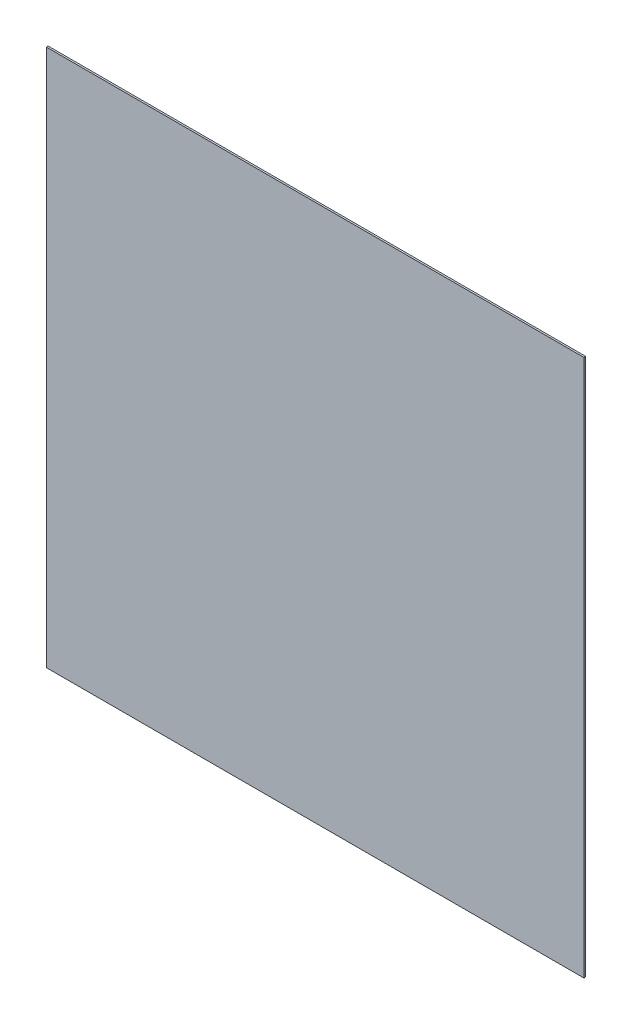
ISO-10303-21;
HEADER;
FILE_DESCRIPTION(('STEP AP214'),'2;1');
FILE_NAME('part.step','',(''),(''),'','','');
FILE_SCHEMA(('AUTOMOTIVE_DESIGN { 1 0 10303 214 1 1 1 1 }'));
ENDSEC;
DATA;
#1=APPLICATION_CONTEXT('core data for automotive mechanical design processes');
#2=APPLICATION_PROTOCOL_DEFINITION('international standard','automotive_design',2000,#1);
#3=PRODUCT_CONTEXT('',#1,'mechanical');
#4=PRODUCT('Part','Part','',(#3));
#5=PRODUCT_RELATED_PRODUCT_CATEGORY('part','',(#4));
#6=PRODUCT_DEFINITION_FORMATION('','',#4);
#7=PRODUCT_DEFINITION_CONTEXT('part definition',#1,'design');
#8=PRODUCT_DEFINITION('design','',#6,#7);
#9=PRODUCT_DEFINITION_SHAPE('','',#8);
#10=(LENGTH_UNIT() NAMED_UNIT(*) SI_UNIT(.MILLI.,.METRE.));
#11=(NAMED_UNIT(*) PLANE_ANGLE_UNIT() SI_UNIT($,.RADIAN.));
#12=(NAMED_UNIT(*) SI_UNIT($,.STERADIAN.) SOLID_ANGLE_UNIT());
#13=UNCERTAINTY_MEASURE_WITH_UNIT(LENGTH_MEASURE(1.E-05),#10,'distance_accuracy_value','');
#14=(GEOMETRIC_REPRESENTATION_CONTEXT(3) GLOBAL_UNCERTAINTY_ASSIGNED_CONTEXT((#13)) GLOBAL_UNIT_ASSIGNED_CONTEXT((#10,
#11,#12)) REPRESENTATION_CONTEXT('',''));
#15=CARTESIAN_POINT('',(0.,0.,0.));
#16=DIRECTION('',(0.,0.,1.));
#17=DIRECTION('',(1.,0.,0.));
#18=AXIS2_PLACEMENT_3D('',#15,#16,#17);
#19=CARTESIAN_POINT('',(0.,0.,1.));
#20=DIRECTION('',(1.,0.,0.));
#21=DIRECTION('',(0.,1.,0.));
#22=AXIS2_PLACEMENT_3D('',#19,#20,#21);
#23=PLANE('',#22);
#24=DIRECTION('',(0.,-1.,0.));
#25=VECTOR('',#24,1.);
#26=CARTESIAN_POINT('',(0.,0.,0.));
#27=LINE('',#26,#25);
#28=CARTESIAN_POINT('',(0.,300.,0.));
#29=VERTEX_POINT('',#28);
#30=CARTESIAN_POINT('',(0.,0.,0.));
#31=VERTEX_POINT('',#30);
#32=EDGE_CURVE('E107',#29,#31,#27,.T.);
#33=ORIENTED_EDGE('',*,*,#32,.T.);
#34=DIRECTION('',(0.,0.,-1.));
#35=VECTOR('',#34,1.);
#36=CARTESIAN_POINT('',(0.,0.,1.));
#37=LINE('',#36,#35);
#38=CARTESIAN_POINT('',(0.,0.,1.));
#39=VERTEX_POINT('',#38);
#40=EDGE_CURVE('E11',#39,#31,#37,.T.);
#41=ORIENTED_EDGE('',*,*,#40,.F.);
#42=DIRECTION('',(0.,-1.,0.));
#43=VECTOR('',#42,1.);
#44=CARTESIAN_POINT('',(0.,0.,1.));
#45=LINE('',#44,#43);
#46=CARTESIAN_POINT('',(0.,300.,1.));
#47=VERTEX_POINT('',#46);
#48=EDGE_CURVE('E91',#47,#39,#45,.T.);
#49=ORIENTED_EDGE('',*,*,#48,.F.);
#50=DIRECTION('',(0.,0.,-1.));
#51=VECTOR('',#50,1.);
#52=CARTESIAN_POINT('',(0.,300.,1.));
#53=LINE('',#52,#51);
#54=EDGE_CURVE('E103',#47,#29,#53,.T.);
#55=ORIENTED_EDGE('',*,*,#54,.T.);
#56=EDGE_LOOP('',(#33,#41,#49,#55));
#57=FACE_BOUND('',#56,.T.);
#58=ADVANCED_FACE('F39',(#57),#23,.F.);
#59=CARTESIAN_POINT('',(0.,0.,1.));
#60=DIRECTION('',(0.,1.,0.));
#61=DIRECTION('',(0.,0.,1.));
#62=AXIS2_PLACEMENT_3D('',#59,#60,#61);
#63=PLANE('',#62);
#64=DIRECTION('',(1.,0.,0.));
#65=VECTOR('',#64,1.);
#66=CARTESIAN_POINT('',(0.,0.,0.));
#67=LINE('',#66,#65);
#68=CARTESIAN_POINT('',(300.,0.,0.));
#69=VERTEX_POINT('',#68);
#70=EDGE_CURVE('E96',#31,#69,#67,.T.);
#71=ORIENTED_EDGE('',*,*,#70,.T.);
#72=DIRECTION('',(0.,0.,-1.));
#73=VECTOR('',#72,1.);
#74=CARTESIAN_POINT('',(300.,0.,1.));
#75=LINE('',#74,#73);
#76=CARTESIAN_POINT('',(300.,0.,1.));
#77=VERTEX_POINT('',#76);
#78=EDGE_CURVE('E48',#77,#69,#75,.T.);
#79=ORIENTED_EDGE('',*,*,#78,.F.);
#80=DIRECTION('',(1.,0.,0.));
#81=VECTOR('',#80,1.);
#82=CARTESIAN_POINT('',(0.,0.,1.));
#83=LINE('',#82,#81);
#84=EDGE_CURVE('E86',#39,#77,#83,.T.);
#85=ORIENTED_EDGE('',*,*,#84,.F.);
#86=ORIENTED_EDGE('',*,*,#40,.T.);
#87=EDGE_LOOP('',(#71,#79,#85,#86));
#88=FACE_BOUND('',#87,.T.);
#89=ADVANCED_FACE('F95',(#88),#63,.F.);
#90=CARTESIAN_POINT('',(300.,0.,1.));
#91=DIRECTION('',(-1.,0.,0.));
#92=DIRECTION('',(0.,0.,1.));
#93=AXIS2_PLACEMENT_3D('',#90,#91,#92);
#94=PLANE('',#93);
#95=DIRECTION('',(0.,1.,0.));
#96=VECTOR('',#95,1.);
#97=CARTESIAN_POINT('',(300.,0.,0.));
#98=LINE('',#97,#96);
#99=CARTESIAN_POINT('',(300.,300.,0.));
#100=VERTEX_POINT('',#99);
#101=EDGE_CURVE('E73',#69,#100,#98,.T.);
#102=ORIENTED_EDGE('',*,*,#101,.T.);
#103=DIRECTION('',(0.,0.,-1.));
#104=VECTOR('',#103,1.);
#105=CARTESIAN_POINT('',(300.,300.,1.));
#106=LINE('',#105,#104);
#107=CARTESIAN_POINT('',(300.,300.,1.));
#108=VERTEX_POINT('',#107);
#109=EDGE_CURVE('E98',#108,#100,#106,.T.);
#110=ORIENTED_EDGE('',*,*,#109,.F.);
#111=DIRECTION('',(0.,1.,0.));
#112=VECTOR('',#111,1.);
#113=CARTESIAN_POINT('',(300.,0.,1.));
#114=LINE('',#113,#112);
#115=EDGE_CURVE('E89',#77,#108,#114,.T.);
#116=ORIENTED_EDGE('',*,*,#115,.F.);
#117=ORIENTED_EDGE('',*,*,#78,.T.);
#118=EDGE_LOOP('',(#102,#110,#116,#117));
#119=FACE_BOUND('',#118,.T.);
#120=ADVANCED_FACE('F99',(#119),#94,.F.);
#121=CARTESIAN_POINT('',(0.,300.,1.));
#122=DIRECTION('',(0.,-1.,0.));
#123=DIRECTION('',(0.,0.,-1.));
#124=AXIS2_PLACEMENT_3D('',#121,#122,#123);
#125=PLANE('',#124);
#126=DIRECTION('',(-1.,0.,0.));
#127=VECTOR('',#126,1.);
#128=CARTESIAN_POINT('',(0.,300.,0.));
#129=LINE('',#128,#127);
#130=EDGE_CURVE('E79',#100,#29,#129,.T.);
#131=ORIENTED_EDGE('',*,*,#130,.T.);
#132=ORIENTED_EDGE('',*,*,#54,.F.);
#133=DIRECTION('',(-1.,0.,0.));
#134=VECTOR('',#133,1.);
#135=CARTESIAN_POINT('',(0.,300.,1.));
#136=LINE('',#135,#134);
#137=EDGE_CURVE('E56',#108,#47,#136,.T.);
#138=ORIENTED_EDGE('',*,*,#137,.F.);
#139=ORIENTED_EDGE('',*,*,#109,.T.);
#140=EDGE_LOOP('',(#131,#132,#138,#139));
#141=FACE_BOUND('',#140,.T.);
#142=ADVANCED_FACE('F120',(#141),#125,.F.);
#143=CARTESIAN_POINT('',(0.,0.,1.));
#144=DIRECTION('',(0.,0.,-1.));
#145=DIRECTION('',(-1.,0.,0.));
#146=AXIS2_PLACEMENT_3D('',#143,#144,#145);
#147=PLANE('',#146);
#148=ORIENTED_EDGE('',*,*,#48,.T.);
#149=ORIENTED_EDGE('',*,*,#84,.T.);
#150=ORIENTED_EDGE('',*,*,#115,.T.);
#151=ORIENTED_EDGE('',*,*,#137,.T.);
#152=EDGE_LOOP('',(#148,#149,#150,#151));
#153=FACE_BOUND('',#152,.T.);
#154=ADVANCED_FACE('F87',(#153),#147,.F.);
#155=CARTESIAN_POINT('',(0.,0.,0.));
#156=DIRECTION('',(0.,0.,-1.));
#157=DIRECTION('',(-1.,0.,0.));
#158=AXIS2_PLACEMENT_3D('',#155,#156,#157);
#159=PLANE('',#158);
#160=ORIENTED_EDGE('',*,*,#32,.F.);
#161=ORIENTED_EDGE('',*,*,#130,.F.);
#162=ORIENTED_EDGE('',*,*,#101,.F.);
#163=ORIENTED_EDGE('',*,*,#70,.F.);
#164=EDGE_LOOP('',(#160,#161,#162,#163));
#165=FACE_BOUND('',#164,.T.);
#166=ADVANCED_FACE('F123',(#165),#159,.T.);
#167=CLOSED_SHELL('',(#58,#89,#120,#142,#154,#166));
#168=MANIFOLD_SOLID_BREP('B2',#167);
#169=ADVANCED_BREP_SHAPE_REPRESENTATION('',(#18,#168),#14);
#170=SHAPE_DEFINITION_REPRESENTATION(#9,#169);
ENDSEC;
END-ISO-10303-21;
